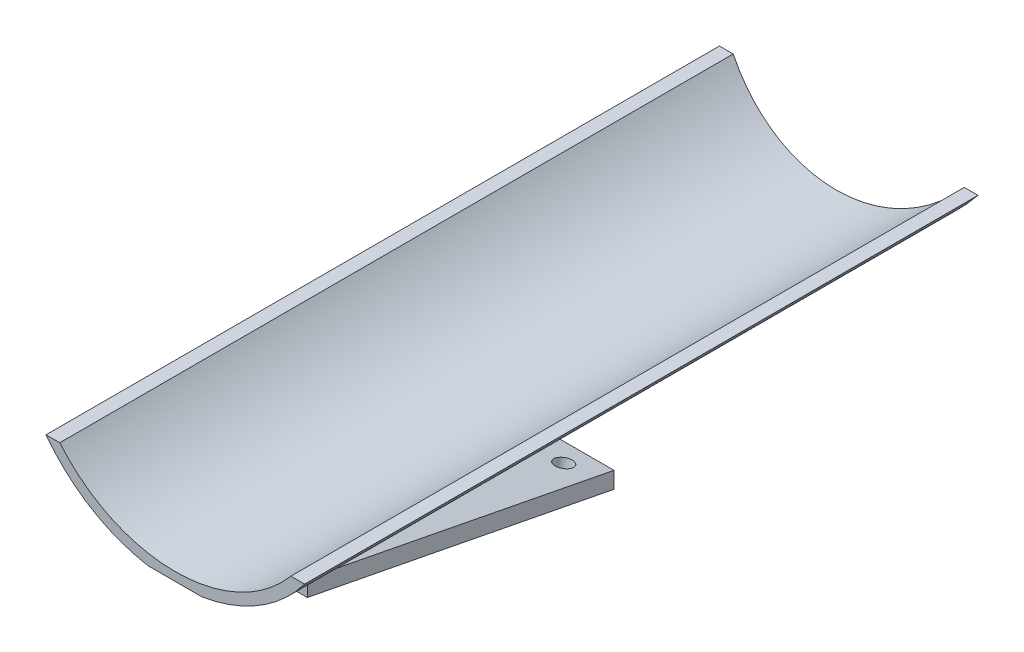
ISO-10303-21;
HEADER;
FILE_DESCRIPTION(('STEP AP214'),'2;1');
FILE_NAME('part.step','',(''),(''),'','','');
FILE_SCHEMA(('AUTOMOTIVE_DESIGN { 1 0 10303 214 1 1 1 1 }'));
ENDSEC;
DATA;
#1=APPLICATION_CONTEXT('core data for automotive mechanical design processes');
#2=APPLICATION_PROTOCOL_DEFINITION('international standard','automotive_design',2000,#1);
#3=PRODUCT_CONTEXT('',#1,'mechanical');
#4=PRODUCT('Part','Part','',(#3));
#5=PRODUCT_RELATED_PRODUCT_CATEGORY('part','',(#4));
#6=PRODUCT_DEFINITION_FORMATION('','',#4);
#7=PRODUCT_DEFINITION_CONTEXT('part definition',#1,'design');
#8=PRODUCT_DEFINITION('design','',#6,#7);
#9=PRODUCT_DEFINITION_SHAPE('','',#8);
#10=(LENGTH_UNIT() NAMED_UNIT(*) SI_UNIT(.MILLI.,.METRE.));
#11=(NAMED_UNIT(*) PLANE_ANGLE_UNIT() SI_UNIT($,.RADIAN.));
#12=(NAMED_UNIT(*) SI_UNIT($,.STERADIAN.) SOLID_ANGLE_UNIT());
#13=UNCERTAINTY_MEASURE_WITH_UNIT(LENGTH_MEASURE(1.E-05),#10,'distance_accuracy_value','');
#14=(GEOMETRIC_REPRESENTATION_CONTEXT(3) GLOBAL_UNCERTAINTY_ASSIGNED_CONTEXT((#13)) GLOBAL_UNIT_ASSIGNED_CONTEXT((#10,
#11,#12)) REPRESENTATION_CONTEXT('',''));
#15=CARTESIAN_POINT('',(0.,0.,0.));
#16=DIRECTION('',(0.,0.,1.));
#17=DIRECTION('',(1.,0.,0.));
#18=AXIS2_PLACEMENT_3D('',#15,#16,#17);
#19=CARTESIAN_POINT('',(2.5,-24.9798843569898,56.0656233600354));
#20=DIRECTION('',(0.,0.981627183447665,-0.190808995376538));
#21=DIRECTION('',(0.,0.190808995376538,0.981627183447665));
#22=AXIS2_PLACEMENT_3D('',#19,#20,#21);
#23=PLANE('',#22);
#24=CARTESIAN_POINT('',(-7.5,-24.0258393801071,60.9737592772737));
#25=DIRECTION('',(0.,-0.981627183447665,0.190808995376538));
#26=DIRECTION('',(0.,-0.190808995376538,-0.981627183447665));
#27=AXIS2_PLACEMENT_3D('',#24,#25,#26);
#28=CIRCLE('',#27,1.60000000000001);
#29=CARTESIAN_POINT('',(-7.5,-24.3311337727096,59.4031557837575));
#30=VERTEX_POINT('',#29);
#31=EDGE_CURVE('E207',#30,#30,#28,.T.);
#32=ORIENTED_EDGE('',*,*,#31,.F.);
#33=EDGE_LOOP('',(#32));
#34=FACE_BOUND('',#33,.T.);
#35=DIRECTION('',(0.,-0.190808995376538,-0.981627183447665));
#36=VECTOR('',#35,1.);
#37=CARTESIAN_POINT('',(-2.5,-24.9798843569898,56.0656233600354));
#38=LINE('',#37,#36);
#39=CARTESIAN_POINT('',(-2.50000000000001,-13.9129626251506,113.));
#40=VERTEX_POINT('',#39);
#41=CARTESIAN_POINT('',(-2.50000000000001,-24.9798843569898,56.0656233600354));
#42=VERTEX_POINT('',#41);
#43=EDGE_CURVE('E50',#40,#42,#38,.T.);
#44=ORIENTED_EDGE('',*,*,#43,.F.);
#45=DIRECTION('',(-1.,0.,0.));
#46=VECTOR('',#45,1.);
#47=CARTESIAN_POINT('',(2.5,-13.9129626251506,113.));
#48=LINE('',#47,#46);
#49=CARTESIAN_POINT('',(-12.5,-13.9129626251506,113.));
#50=VERTEX_POINT('',#49);
#51=EDGE_CURVE('E278',#40,#50,#48,.T.);
#52=ORIENTED_EDGE('',*,*,#51,.T.);
#53=DIRECTION('',(0.,-0.190808995376538,-0.981627183447665));
#54=VECTOR('',#53,1.);
#55=CARTESIAN_POINT('',(-12.5,-24.9798843569898,56.0656233600354));
#56=LINE('',#55,#54);
#57=CARTESIAN_POINT('',(-12.5,-24.9798843569898,56.0656233600354));
#58=VERTEX_POINT('',#57);
#59=EDGE_CURVE('E215',#50,#58,#56,.T.);
#60=ORIENTED_EDGE('',*,*,#59,.T.);
#61=DIRECTION('',(-1.,0.,0.));
#62=VECTOR('',#61,1.);
#63=CARTESIAN_POINT('',(2.5,-24.9798843569898,56.0656233600354));
#64=LINE('',#63,#62);
#65=EDGE_CURVE('E274',#42,#58,#64,.T.);
#66=ORIENTED_EDGE('',*,*,#65,.F.);
#67=EDGE_LOOP('',(#44,#52,#60,#66));
#68=FACE_BOUND('',#67,.T.);
#69=ADVANCED_FACE('F35',(#34,#68),#23,.F.);
#70=CARTESIAN_POINT('',(7.5,-24.0258393801071,60.9737592772737));
#71=DIRECTION('',(0.,-0.981627183447665,0.190808995376538));
#72=DIRECTION('',(0.,-0.190808995376538,-0.981627183447665));
#73=AXIS2_PLACEMENT_3D('',#70,#71,#72);
#74=CIRCLE('',#73,1.60000000000001);
#75=CARTESIAN_POINT('',(7.5,-24.3311337727096,59.4031557837575));
#76=VERTEX_POINT('',#75);
#77=EDGE_CURVE('E196',#76,#76,#74,.T.);
#78=ORIENTED_EDGE('',*,*,#77,.F.);
#79=EDGE_LOOP('',(#78));
#80=FACE_BOUND('',#79,.T.);
#81=DIRECTION('',(0.,0.190808995376538,0.981627183447665));
#82=VECTOR('',#81,1.);
#83=CARTESIAN_POINT('',(2.5,-24.9798843569898,56.0656233600354));
#84=LINE('',#83,#82);
#85=CARTESIAN_POINT('',(2.5,-24.9798843569898,56.0656233600354));
#86=VERTEX_POINT('',#85);
#87=CARTESIAN_POINT('',(2.49999999999999,-13.9129626251506,113.));
#88=VERTEX_POINT('',#87);
#89=EDGE_CURVE('E379',#86,#88,#84,.T.);
#90=ORIENTED_EDGE('',*,*,#89,.F.);
#91=CARTESIAN_POINT('',(12.5,-24.9798843569898,56.0656233600354));
#92=VERTEX_POINT('',#91);
#93=EDGE_CURVE('E275',#92,#86,#64,.T.);
#94=ORIENTED_EDGE('',*,*,#93,.F.);
#95=DIRECTION('',(0.,-0.190808995376538,-0.981627183447665));
#96=VECTOR('',#95,1.);
#97=CARTESIAN_POINT('',(12.5,-24.9798843569898,56.0656233600354));
#98=LINE('',#97,#96);
#99=CARTESIAN_POINT('',(12.5,-13.9129626251506,113.));
#100=VERTEX_POINT('',#99);
#101=EDGE_CURVE('E222',#100,#92,#98,.T.);
#102=ORIENTED_EDGE('',*,*,#101,.F.);
#103=EDGE_CURVE('E279',#100,#88,#48,.T.);
#104=ORIENTED_EDGE('',*,*,#103,.T.);
#105=EDGE_LOOP('',(#90,#94,#102,#104));
#106=FACE_BOUND('',#105,.T.);
#107=ADVANCED_FACE('F378',(#80,#106),#23,.F.);
#108=CARTESIAN_POINT('',(5.,-11.5803989154981,125.));
#109=DIRECTION('',(0.,1.,0.));
#110=DIRECTION('',(0.,0.,1.));
#111=AXIS2_PLACEMENT_3D('',#108,#109,#110);
#112=PLANE('',#111);
#113=DIRECTION('',(-1.,0.,0.));
#114=VECTOR('',#113,1.);
#115=CARTESIAN_POINT('',(12.5,-11.5803989154981,109.277470807496));
#116=LINE('',#115,#114);
#117=CARTESIAN_POINT('',(-2.5,-11.5803989154981,109.277470807496));
#118=VERTEX_POINT('',#117);
#119=CARTESIAN_POINT('',(-4.99999999999997,-11.5803989154981,109.277470807496));
#120=VERTEX_POINT('',#119);
#121=EDGE_CURVE('E341',#118,#120,#116,.T.);
#122=ORIENTED_EDGE('',*,*,#121,.T.);
#123=DIRECTION('',(0.,0.,-1.));
#124=VECTOR('',#123,1.);
#125=CARTESIAN_POINT('',(-5.00000000000002,-11.5803989154981,125.));
#126=LINE('',#125,#124);
#127=CARTESIAN_POINT('',(-5.00000000000002,-11.5803989154981,2.67354575013348));
#128=VERTEX_POINT('',#127);
#129=EDGE_CURVE('E315',#120,#128,#126,.T.);
#130=ORIENTED_EDGE('',*,*,#129,.T.);
#131=DIRECTION('',(1.,0.,0.));
#132=VECTOR('',#131,1.);
#133=CARTESIAN_POINT('',(5.,-11.5803989154981,2.67354575013348));
#134=LINE('',#133,#132);
#135=CARTESIAN_POINT('',(5.,-11.5803989154981,2.67354575013348));
#136=VERTEX_POINT('',#135);
#137=EDGE_CURVE('E285',#128,#136,#134,.T.);
#138=ORIENTED_EDGE('',*,*,#137,.T.);
#139=DIRECTION('',(0.,0.,-1.));
#140=VECTOR('',#139,1.);
#141=CARTESIAN_POINT('',(5.,-11.5803989154981,125.));
#142=LINE('',#141,#140);
#143=CARTESIAN_POINT('',(5.,-11.5803989154981,109.277470807496));
#144=VERTEX_POINT('',#143);
#145=EDGE_CURVE('E58',#144,#136,#142,.T.);
#146=ORIENTED_EDGE('',*,*,#145,.F.);
#147=CARTESIAN_POINT('',(2.5,-11.5803989154981,109.277470807496));
#148=VERTEX_POINT('',#147);
#149=EDGE_CURVE('E247',#144,#148,#116,.T.);
#150=ORIENTED_EDGE('',*,*,#149,.T.);
#151=DIRECTION('',(0.,0.,1.));
#152=VECTOR('',#151,1.);
#153=CARTESIAN_POINT('',(2.5,-11.5803989154981,113.));
#154=LINE('',#153,#152);
#155=CARTESIAN_POINT('',(2.5,-11.5803989154981,56.0656233600354));
#156=VERTEX_POINT('',#155);
#157=EDGE_CURVE('E262',#156,#148,#154,.T.);
#158=ORIENTED_EDGE('',*,*,#157,.F.);
#159=DIRECTION('',(-1.,0.,0.));
#160=VECTOR('',#159,1.);
#161=CARTESIAN_POINT('',(2.5,-11.5803989154981,56.0656233600354));
#162=LINE('',#161,#160);
#163=CARTESIAN_POINT('',(-2.5,-11.5803989154981,56.0656233600354));
#164=VERTEX_POINT('',#163);
#165=EDGE_CURVE('E271',#156,#164,#162,.T.);
#166=ORIENTED_EDGE('',*,*,#165,.T.);
#167=DIRECTION('',(0.,0.,1.));
#168=VECTOR('',#167,1.);
#169=CARTESIAN_POINT('',(-2.5,-11.5803989154981,113.));
#170=LINE('',#169,#168);
#171=EDGE_CURVE('E263',#164,#118,#170,.T.);
#172=ORIENTED_EDGE('',*,*,#171,.T.);
#173=EDGE_LOOP('',(#122,#130,#138,#146,#150,#158,#166,#172));
#174=FACE_BOUND('',#173,.T.);
#175=ADVANCED_FACE('F339',(#174),#112,.F.);
#176=DIRECTION('',(-1.,0.,0.));
#177=VECTOR('',#176,1.);
#178=CARTESIAN_POINT('',(2.5,-11.5803989154981,113.));
#179=LINE('',#178,#177);
#180=CARTESIAN_POINT('',(5.,-11.5803989154981,113.));
#181=VERTEX_POINT('',#180);
#182=CARTESIAN_POINT('',(-4.99999999999999,-11.5803989154981,113.));
#183=VERTEX_POINT('',#182);
#184=EDGE_CURVE('E266',#181,#183,#179,.T.);
#185=ORIENTED_EDGE('',*,*,#184,.F.);
#186=CARTESIAN_POINT('',(5.,-11.5803989154981,125.));
#187=VERTEX_POINT('',#186);
#188=EDGE_CURVE('E312',#187,#181,#142,.T.);
#189=ORIENTED_EDGE('',*,*,#188,.F.);
#190=DIRECTION('',(1.,0.,0.));
#191=VECTOR('',#190,1.);
#192=CARTESIAN_POINT('',(5.,-11.5803989154981,125.));
#193=LINE('',#192,#191);
#194=CARTESIAN_POINT('',(-5.00000000000002,-11.5803989154981,125.));
#195=VERTEX_POINT('',#194);
#196=EDGE_CURVE('E306',#195,#187,#193,.T.);
#197=ORIENTED_EDGE('',*,*,#196,.F.);
#198=EDGE_CURVE('E316',#195,#183,#126,.T.);
#199=ORIENTED_EDGE('',*,*,#198,.T.);
#200=EDGE_LOOP('',(#185,#189,#197,#199));
#201=FACE_BOUND('',#200,.T.);
#202=ADVANCED_FACE('F360',(#201),#112,.F.);
#203=CARTESIAN_POINT('',(2.5,0.,0.));
#204=DIRECTION('',(-1.,0.,0.));
#205=DIRECTION('',(0.,0.,1.));
#206=AXIS2_PLACEMENT_3D('',#203,#204,#205);
#207=PLANE('',#206);
#208=DIRECTION('',(0.,0.190808995376538,0.981627183447665));
#209=VECTOR('',#208,1.);
#210=CARTESIAN_POINT('',(2.5,-31.626809447846,6.1476289975118));
#211=LINE('',#210,#209);
#212=CARTESIAN_POINT('',(2.5,-21.9237342721242,56.0656233600354));
#213=VERTEX_POINT('',#212);
#214=EDGE_CURVE('E256',#213,#148,#211,.T.);
#215=ORIENTED_EDGE('',*,*,#214,.F.);
#216=DIRECTION('',(0.,1.,0.));
#217=VECTOR('',#216,1.);
#218=CARTESIAN_POINT('',(2.5,-11.5803989154981,56.0656233600354));
#219=LINE('',#218,#217);
#220=EDGE_CURVE('E260',#213,#156,#219,.T.);
#221=ORIENTED_EDGE('',*,*,#220,.T.);
#222=ORIENTED_EDGE('',*,*,#157,.T.);
#223=EDGE_LOOP('',(#215,#221,#222));
#224=FACE_BOUND('',#223,.T.);
#225=ADVANCED_FACE('F459',(#224),#207,.F.);
#226=CARTESIAN_POINT('',(-2.5,0.,0.));
#227=DIRECTION('',(-1.,0.,0.));
#228=DIRECTION('',(0.,0.,1.));
#229=AXIS2_PLACEMENT_3D('',#226,#227,#228);
#230=PLANE('',#229);
#231=DIRECTION('',(0.,1.,0.));
#232=VECTOR('',#231,1.);
#233=CARTESIAN_POINT('',(-2.5,-11.5803989154981,56.0656233600354));
#234=LINE('',#233,#232);
#235=CARTESIAN_POINT('',(-2.5,-21.9237342721242,56.0656233600354));
#236=VERTEX_POINT('',#235);
#237=EDGE_CURVE('E259',#236,#164,#234,.T.);
#238=ORIENTED_EDGE('',*,*,#237,.F.);
#239=DIRECTION('',(0.,0.190808995376538,0.981627183447665));
#240=VECTOR('',#239,1.);
#241=CARTESIAN_POINT('',(-2.5,-31.626809447846,6.1476289975118));
#242=LINE('',#241,#240);
#243=EDGE_CURVE('E12',#236,#118,#242,.T.);
#244=ORIENTED_EDGE('',*,*,#243,.T.);
#245=ORIENTED_EDGE('',*,*,#171,.F.);
#246=EDGE_LOOP('',(#238,#244,#245));
#247=FACE_BOUND('',#246,.T.);
#248=ADVANCED_FACE('F455',(#247),#230,.T.);
#249=CARTESIAN_POINT('',(0.,18.,125.));
#250=DIRECTION('',(0.,0.,-1.));
#251=DIRECTION('',(-1.,0.,0.));
#252=AXIS2_PLACEMENT_3D('',#249,#250,#251);
#253=CYLINDRICAL_SURFACE('',#252,30.);
#254=ORIENTED_EDGE('',*,*,#188,.T.);
#255=DIRECTION('',(0.,0.,-1.));
#256=VECTOR('',#255,1.);
#257=CARTESIAN_POINT('',(4.99999999999995,-11.5803989154981,125.));
#258=LINE('',#257,#256);
#259=EDGE_CURVE('E253',#144,#181,#258,.F.);
#260=ORIENTED_EDGE('',*,*,#259,.F.);
#261=ORIENTED_EDGE('',*,*,#145,.T.);
#262=CARTESIAN_POINT('',(0.,18.,-4.15562744026013));
#263=DIRECTION('',(0.,0.224951054343866,0.974370064785235));
#264=DIRECTION('',(0.,0.974370064785235,-0.224951054343866));
#265=AXIS2_PLACEMENT_3D('',#262,#263,#264);
#266=ELLIPSE('',#265,30.7891232338017,30.);
#267=CARTESIAN_POINT('',(24.,0.,0.));
#268=VERTEX_POINT('',#267);
#269=EDGE_CURVE('E287',#136,#268,#266,.T.);
#270=ORIENTED_EDGE('',*,*,#269,.T.);
#271=DIRECTION('',(0.,0.,-1.));
#272=VECTOR('',#271,1.);
#273=CARTESIAN_POINT('',(24.,0.,125.));
#274=LINE('',#273,#272);
#275=CARTESIAN_POINT('',(24.,0.,125.));
#276=VERTEX_POINT('',#275);
#277=EDGE_CURVE('E43',#276,#268,#274,.T.);
#278=ORIENTED_EDGE('',*,*,#277,.F.);
#279=CARTESIAN_POINT('',(0.,18.,125.));
#280=DIRECTION('',(0.,0.,1.));
#281=DIRECTION('',(1.,0.,0.));
#282=AXIS2_PLACEMENT_3D('',#279,#280,#281);
#283=CIRCLE('',#282,30.);
#284=EDGE_CURVE('E294',#187,#276,#283,.T.);
#285=ORIENTED_EDGE('',*,*,#284,.F.);
#286=EDGE_LOOP('',(#254,#260,#261,#270,#278,#285));
#287=FACE_BOUND('',#286,.T.);
#288=ADVANCED_FACE('F37',(#287),#253,.T.);
#289=CARTESIAN_POINT('',(21.4476105895272,0.,125.));
#290=DIRECTION('',(0.,-1.,0.));
#291=DIRECTION('',(0.,0.,-1.));
#292=AXIS2_PLACEMENT_3D('',#289,#290,#291);
#293=PLANE('',#292);
#294=DIRECTION('',(-1.,0.,0.));
#295=VECTOR('',#294,1.);
#296=CARTESIAN_POINT('',(21.4476105895272,0.,0.));
#297=LINE('',#296,#295);
#298=CARTESIAN_POINT('',(21.4476105895272,0.,0.));
#299=VERTEX_POINT('',#298);
#300=EDGE_CURVE('E293',#268,#299,#297,.T.);
#301=ORIENTED_EDGE('',*,*,#300,.T.);
#302=DIRECTION('',(0.,0.,-1.));
#303=VECTOR('',#302,1.);
#304=CARTESIAN_POINT('',(21.4476105895272,0.,125.));
#305=LINE('',#304,#303);
#306=CARTESIAN_POINT('',(21.4476105895272,0.,125.));
#307=VERTEX_POINT('',#306);
#308=EDGE_CURVE('E325',#307,#299,#305,.T.);
#309=ORIENTED_EDGE('',*,*,#308,.F.);
#310=DIRECTION('',(-1.,0.,0.));
#311=VECTOR('',#310,1.);
#312=CARTESIAN_POINT('',(21.4476105895272,0.,125.));
#313=LINE('',#312,#311);
#314=EDGE_CURVE('E297',#276,#307,#313,.T.);
#315=ORIENTED_EDGE('',*,*,#314,.F.);
#316=ORIENTED_EDGE('',*,*,#277,.T.);
#317=EDGE_LOOP('',(#301,#309,#315,#316));
#318=FACE_BOUND('',#317,.T.);
#319=ADVANCED_FACE('F330',(#318),#293,.F.);
#320=CARTESIAN_POINT('',(0.,18.,125.));
#321=DIRECTION('',(0.,0.,-1.));
#322=DIRECTION('',(-1.,0.,0.));
#323=AXIS2_PLACEMENT_3D('',#320,#321,#322);
#324=CYLINDRICAL_SURFACE('',#323,28.);
#325=ORIENTED_EDGE('',*,*,#308,.T.);
#326=CARTESIAN_POINT('',(0.,18.,-4.15562744026013));
#327=DIRECTION('',(0.,0.224951054343866,0.974370064785235));
#328=DIRECTION('',(0.,0.974370064785235,-0.224951054343866));
#329=AXIS2_PLACEMENT_3D('',#326,#327,#328);
#330=ELLIPSE('',#329,28.736515018215,28.);
#331=CARTESIAN_POINT('',(-21.4476105895272,0.,0.));
#332=VERTEX_POINT('',#331);
#333=EDGE_CURVE('E290',#299,#332,#330,.F.);
#334=ORIENTED_EDGE('',*,*,#333,.T.);
#335=DIRECTION('',(0.,0.,-1.));
#336=VECTOR('',#335,1.);
#337=CARTESIAN_POINT('',(-21.4476105895272,0.,125.));
#338=LINE('',#337,#336);
#339=CARTESIAN_POINT('',(-21.4476105895272,0.,125.));
#340=VERTEX_POINT('',#339);
#341=EDGE_CURVE('E322',#340,#332,#338,.T.);
#342=ORIENTED_EDGE('',*,*,#341,.F.);
#343=CARTESIAN_POINT('',(0.,18.,125.));
#344=DIRECTION('',(0.,0.,-1.));
#345=DIRECTION('',(-1.,0.,0.));
#346=AXIS2_PLACEMENT_3D('',#343,#344,#345);
#347=CIRCLE('',#346,28.);
#348=EDGE_CURVE('E300',#307,#340,#347,.T.);
#349=ORIENTED_EDGE('',*,*,#348,.F.);
#350=EDGE_LOOP('',(#325,#334,#342,#349));
#351=FACE_BOUND('',#350,.T.);
#352=ADVANCED_FACE('F354',(#351),#324,.F.);
#353=CARTESIAN_POINT('',(-24.,0.,125.));
#354=DIRECTION('',(0.,-1.,0.));
#355=DIRECTION('',(0.,0.,-1.));
#356=AXIS2_PLACEMENT_3D('',#353,#354,#355);
#357=PLANE('',#356);
#358=DIRECTION('',(-1.,0.,0.));
#359=VECTOR('',#358,1.);
#360=CARTESIAN_POINT('',(-24.,0.,0.));
#361=LINE('',#360,#359);
#362=CARTESIAN_POINT('',(-24.,0.,0.));
#363=VERTEX_POINT('',#362);
#364=EDGE_CURVE('E298',#332,#363,#361,.T.);
#365=ORIENTED_EDGE('',*,*,#364,.T.);
#366=DIRECTION('',(0.,0.,-1.));
#367=VECTOR('',#366,1.);
#368=CARTESIAN_POINT('',(-24.,0.,125.));
#369=LINE('',#368,#367);
#370=CARTESIAN_POINT('',(-24.,0.,125.));
#371=VERTEX_POINT('',#370);
#372=EDGE_CURVE('E319',#371,#363,#369,.T.);
#373=ORIENTED_EDGE('',*,*,#372,.F.);
#374=DIRECTION('',(-1.,0.,0.));
#375=VECTOR('',#374,1.);
#376=CARTESIAN_POINT('',(-24.,0.,125.));
#377=LINE('',#376,#375);
#378=EDGE_CURVE('E302',#340,#371,#377,.T.);
#379=ORIENTED_EDGE('',*,*,#378,.F.);
#380=ORIENTED_EDGE('',*,*,#341,.T.);
#381=EDGE_LOOP('',(#365,#373,#379,#380));
#382=FACE_BOUND('',#381,.T.);
#383=ADVANCED_FACE('F349',(#382),#357,.F.);
#384=CARTESIAN_POINT('',(0.,18.,125.));
#385=DIRECTION('',(0.,0.,-1.));
#386=DIRECTION('',(-1.,0.,0.));
#387=AXIS2_PLACEMENT_3D('',#384,#385,#386);
#388=CYLINDRICAL_SURFACE('',#387,30.);
#389=ORIENTED_EDGE('',*,*,#372,.T.);
#390=CARTESIAN_POINT('',(0.,18.,-4.15562744026013));
#391=DIRECTION('',(0.,0.224951054343866,0.974370064785235));
#392=DIRECTION('',(0.,0.974370064785235,-0.224951054343866));
#393=AXIS2_PLACEMENT_3D('',#390,#391,#392);
#394=ELLIPSE('',#393,30.7891232338018,30.);
#395=EDGE_CURVE('E282',#363,#128,#394,.T.);
#396=ORIENTED_EDGE('',*,*,#395,.T.);
#397=ORIENTED_EDGE('',*,*,#129,.F.);
#398=DIRECTION('',(0.,0.,-1.));
#399=VECTOR('',#398,1.);
#400=CARTESIAN_POINT('',(-4.99999999999997,-11.5803989154981,125.));
#401=LINE('',#400,#399);
#402=EDGE_CURVE('E251',#183,#120,#401,.T.);
#403=ORIENTED_EDGE('',*,*,#402,.F.);
#404=ORIENTED_EDGE('',*,*,#198,.F.);
#405=CARTESIAN_POINT('',(0.,18.,125.));
#406=DIRECTION('',(0.,0.,1.));
#407=DIRECTION('',(1.,0.,0.));
#408=AXIS2_PLACEMENT_3D('',#405,#406,#407);
#409=CIRCLE('',#408,30.);
#410=EDGE_CURVE('E304',#371,#195,#409,.T.);
#411=ORIENTED_EDGE('',*,*,#410,.F.);
#412=EDGE_LOOP('',(#389,#396,#397,#403,#404,#411));
#413=FACE_BOUND('',#412,.T.);
#414=ADVANCED_FACE('F344',(#413),#388,.T.);
#415=CARTESIAN_POINT('',(0.,18.,125.));
#416=DIRECTION('',(0.,0.,1.));
#417=DIRECTION('',(1.,0.,0.));
#418=AXIS2_PLACEMENT_3D('',#415,#416,#417);
#419=PLANE('',#418);
#420=ORIENTED_EDGE('',*,*,#284,.T.);
#421=ORIENTED_EDGE('',*,*,#314,.T.);
#422=ORIENTED_EDGE('',*,*,#348,.T.);
#423=ORIENTED_EDGE('',*,*,#378,.T.);
#424=ORIENTED_EDGE('',*,*,#410,.T.);
#425=ORIENTED_EDGE('',*,*,#196,.T.);
#426=EDGE_LOOP('',(#420,#421,#422,#423,#424,#425));
#427=FACE_BOUND('',#426,.T.);
#428=ADVANCED_FACE('F356',(#427),#419,.T.);
#429=CARTESIAN_POINT('',(0.,0.,0.));
#430=DIRECTION('',(0.,0.224951054343866,0.974370064785235));
#431=DIRECTION('',(0.,-0.974370064785235,0.224951054343866));
#432=AXIS2_PLACEMENT_3D('',#429,#430,#431);
#433=PLANE('',#432);
#434=ORIENTED_EDGE('',*,*,#300,.F.);
#435=ORIENTED_EDGE('',*,*,#269,.F.);
#436=ORIENTED_EDGE('',*,*,#137,.F.);
#437=ORIENTED_EDGE('',*,*,#395,.F.);
#438=ORIENTED_EDGE('',*,*,#364,.F.);
#439=ORIENTED_EDGE('',*,*,#333,.F.);
#440=EDGE_LOOP('',(#434,#435,#436,#437,#438,#439));
#441=FACE_BOUND('',#440,.T.);
#442=ADVANCED_FACE('F337',(#441),#433,.F.);
#443=CARTESIAN_POINT('',(2.5,-13.9129626251506,113.));
#444=DIRECTION('',(0.,0.,-1.));
#445=DIRECTION('',(-1.,0.,0.));
#446=AXIS2_PLACEMENT_3D('',#443,#444,#445);
#447=PLANE('',#446);
#448=ORIENTED_EDGE('',*,*,#184,.T.);
#449=DIRECTION('',(-1.,0.,0.));
#450=VECTOR('',#449,1.);
#451=CARTESIAN_POINT('',(12.5,-11.5803989154981,113.));
#452=LINE('',#451,#450);
#453=CARTESIAN_POINT('',(-12.5,-11.5803989154981,113.));
#454=VERTEX_POINT('',#453);
#455=EDGE_CURVE('E225',#183,#454,#452,.T.);
#456=ORIENTED_EDGE('',*,*,#455,.T.);
#457=DIRECTION('',(0.,-1.,0.));
#458=VECTOR('',#457,1.);
#459=CARTESIAN_POINT('',(-12.5,-13.9129626251506,113.));
#460=LINE('',#459,#458);
#461=EDGE_CURVE('E234',#454,#50,#460,.T.);
#462=ORIENTED_EDGE('',*,*,#461,.T.);
#463=ORIENTED_EDGE('',*,*,#51,.F.);
#464=DIRECTION('',(-1.,0.,0.));
#465=VECTOR('',#464,1.);
#466=CARTESIAN_POINT('',(-2.50000000000001,-13.9129626251506,113.));
#467=LINE('',#466,#465);
#468=EDGE_CURVE('E190',#88,#40,#467,.T.);
#469=ORIENTED_EDGE('',*,*,#468,.F.);
#470=ORIENTED_EDGE('',*,*,#103,.F.);
#471=DIRECTION('',(0.,-1.,0.));
#472=VECTOR('',#471,1.);
#473=CARTESIAN_POINT('',(12.5,-13.9129626251506,113.));
#474=LINE('',#473,#472);
#475=CARTESIAN_POINT('',(12.5,-11.5803989154981,113.));
#476=VERTEX_POINT('',#475);
#477=EDGE_CURVE('E219',#476,#100,#474,.T.);
#478=ORIENTED_EDGE('',*,*,#477,.F.);
#479=EDGE_CURVE('E239',#476,#181,#452,.T.);
#480=ORIENTED_EDGE('',*,*,#479,.T.);
#481=EDGE_LOOP('',(#448,#456,#462,#463,#469,#470,#478,#480));
#482=FACE_BOUND('',#481,.T.);
#483=ADVANCED_FACE('F369',(#482),#447,.F.);
#484=CARTESIAN_POINT('',(2.5,-11.5803989154981,56.0656233600354));
#485=DIRECTION('',(0.,0.,1.));
#486=DIRECTION('',(1.,0.,0.));
#487=AXIS2_PLACEMENT_3D('',#484,#485,#486);
#488=PLANE('',#487);
#489=ORIENTED_EDGE('',*,*,#93,.T.);
#490=DIRECTION('',(1.,0.,0.));
#491=VECTOR('',#490,1.);
#492=CARTESIAN_POINT('',(-2.5,-24.9798843569898,56.0656233600354));
#493=LINE('',#492,#491);
#494=EDGE_CURVE('E383',#42,#86,#493,.T.);
#495=ORIENTED_EDGE('',*,*,#494,.F.);
#496=ORIENTED_EDGE('',*,*,#65,.T.);
#497=DIRECTION('',(0.,1.,0.));
#498=VECTOR('',#497,1.);
#499=CARTESIAN_POINT('',(-12.5,-21.9237342721242,56.0656233600354));
#500=LINE('',#499,#498);
#501=CARTESIAN_POINT('',(-12.5,-21.9237342721242,56.0656233600354));
#502=VERTEX_POINT('',#501);
#503=EDGE_CURVE('E210',#58,#502,#500,.T.);
#504=ORIENTED_EDGE('',*,*,#503,.T.);
#505=DIRECTION('',(-1.,0.,0.));
#506=VECTOR('',#505,1.);
#507=CARTESIAN_POINT('',(12.5,-21.9237342721242,56.0656233600354));
#508=LINE('',#507,#506);
#509=EDGE_CURVE('E246',#236,#502,#508,.T.);
#510=ORIENTED_EDGE('',*,*,#509,.F.);
#511=ORIENTED_EDGE('',*,*,#237,.T.);
#512=ORIENTED_EDGE('',*,*,#165,.F.);
#513=ORIENTED_EDGE('',*,*,#220,.F.);
#514=CARTESIAN_POINT('',(12.5,-21.9237342721242,56.0656233600354));
#515=VERTEX_POINT('',#514);
#516=EDGE_CURVE('E248',#515,#213,#508,.T.);
#517=ORIENTED_EDGE('',*,*,#516,.F.);
#518=DIRECTION('',(0.,1.,0.));
#519=VECTOR('',#518,1.);
#520=CARTESIAN_POINT('',(12.5,-21.9237342721242,56.0656233600354));
#521=LINE('',#520,#519);
#522=EDGE_CURVE('E211',#92,#515,#521,.T.);
#523=ORIENTED_EDGE('',*,*,#522,.F.);
#524=EDGE_LOOP('',(#489,#495,#496,#504,#510,#511,#512,#513,#517,#523));
#525=FACE_BOUND('',#524,.T.);
#526=ADVANCED_FACE('F382',(#525),#488,.F.);
#527=CARTESIAN_POINT('',(-12.5,0.,0.));
#528=DIRECTION('',(1.,0.,0.));
#529=DIRECTION('',(0.,0.,-1.));
#530=AXIS2_PLACEMENT_3D('',#527,#528,#529);
#531=PLANE('',#530);
#532=ORIENTED_EDGE('',*,*,#503,.F.);
#533=ORIENTED_EDGE('',*,*,#59,.F.);
#534=ORIENTED_EDGE('',*,*,#461,.F.);
#535=DIRECTION('',(0.,0.,1.));
#536=VECTOR('',#535,1.);
#537=CARTESIAN_POINT('',(-12.5,-11.5803989154981,113.));
#538=LINE('',#537,#536);
#539=CARTESIAN_POINT('',(-12.5,-11.5803989154981,109.277470807496));
#540=VERTEX_POINT('',#539);
#541=EDGE_CURVE('E231',#540,#454,#538,.T.);
#542=ORIENTED_EDGE('',*,*,#541,.F.);
#543=DIRECTION('',(0.,0.190808995376538,0.981627183447665));
#544=VECTOR('',#543,1.);
#545=CARTESIAN_POINT('',(-12.5,-11.5803989154981,109.277470807496));
#546=LINE('',#545,#544);
#547=EDGE_CURVE('E228',#502,#540,#546,.T.);
#548=ORIENTED_EDGE('',*,*,#547,.F.);
#549=EDGE_LOOP('',(#532,#533,#534,#542,#548));
#550=FACE_BOUND('',#549,.T.);
#551=ADVANCED_FACE('F400',(#550),#531,.F.);
#552=CARTESIAN_POINT('',(12.5,-11.5803989154981,109.277470807496));
#553=DIRECTION('',(0.,-0.981627183447665,0.190808995376538));
#554=DIRECTION('',(0.,-0.190808995376538,-0.981627183447665));
#555=AXIS2_PLACEMENT_3D('',#552,#553,#554);
#556=PLANE('',#555);
#557=CARTESIAN_POINT('',(-7.5,-21.0809578297641,60.4013322911441));
#558=DIRECTION('',(0.,-0.981627183447665,0.190808995376538));
#559=DIRECTION('',(0.,-0.190808995376538,-0.981627183447665));
#560=AXIS2_PLACEMENT_3D('',#557,#558,#559);
#561=CIRCLE('',#560,1.60000000000001);
#562=CARTESIAN_POINT('',(-7.5,-21.3862522223666,58.8307287976278));
#563=VERTEX_POINT('',#562);
#564=EDGE_CURVE('E204',#563,#563,#561,.F.);
#565=ORIENTED_EDGE('',*,*,#564,.F.);
#566=EDGE_LOOP('',(#565));
#567=FACE_BOUND('',#566,.T.);
#568=ORIENTED_EDGE('',*,*,#243,.F.);
#569=ORIENTED_EDGE('',*,*,#509,.T.);
#570=ORIENTED_EDGE('',*,*,#547,.T.);
#571=EDGE_CURVE('E242',#120,#540,#116,.T.);
#572=ORIENTED_EDGE('',*,*,#571,.F.);
#573=ORIENTED_EDGE('',*,*,#121,.F.);
#574=EDGE_LOOP('',(#568,#569,#570,#572,#573));
#575=FACE_BOUND('',#574,.T.);
#576=ADVANCED_FACE('F396',(#567,#575),#556,.F.);
#577=CARTESIAN_POINT('',(12.5,-11.5803989154981,113.));
#578=DIRECTION('',(0.,-1.,0.));
#579=DIRECTION('',(0.,0.,-1.));
#580=AXIS2_PLACEMENT_3D('',#577,#578,#579);
#581=PLANE('',#580);
#582=ORIENTED_EDGE('',*,*,#455,.F.);
#583=ORIENTED_EDGE('',*,*,#402,.T.);
#584=ORIENTED_EDGE('',*,*,#571,.T.);
#585=ORIENTED_EDGE('',*,*,#541,.T.);
#586=EDGE_LOOP('',(#582,#583,#584,#585));
#587=FACE_BOUND('',#586,.T.);
#588=ADVANCED_FACE('F391',(#587),#581,.F.);
#589=CARTESIAN_POINT('',(7.5,-21.0809578297641,60.4013322911441));
#590=DIRECTION('',(0.,-0.981627183447665,0.190808995376538));
#591=DIRECTION('',(0.,-0.190808995376538,-0.981627183447665));
#592=AXIS2_PLACEMENT_3D('',#589,#590,#591);
#593=CIRCLE('',#592,1.60000000000001);
#594=CARTESIAN_POINT('',(7.5,-21.3862522223666,58.8307287976278));
#595=VERTEX_POINT('',#594);
#596=EDGE_CURVE('E193',#595,#595,#593,.F.);
#597=ORIENTED_EDGE('',*,*,#596,.F.);
#598=EDGE_LOOP('',(#597));
#599=FACE_BOUND('',#598,.T.);
#600=ORIENTED_EDGE('',*,*,#516,.T.);
#601=ORIENTED_EDGE('',*,*,#214,.T.);
#602=ORIENTED_EDGE('',*,*,#149,.F.);
#603=CARTESIAN_POINT('',(12.5,-11.5803989154981,109.277470807496));
#604=VERTEX_POINT('',#603);
#605=EDGE_CURVE('E243',#604,#144,#116,.T.);
#606=ORIENTED_EDGE('',*,*,#605,.F.);
#607=DIRECTION('',(0.,0.190808995376538,0.981627183447665));
#608=VECTOR('',#607,1.);
#609=CARTESIAN_POINT('',(12.5,-11.5803989154981,109.277470807496));
#610=LINE('',#609,#608);
#611=EDGE_CURVE('E214',#515,#604,#610,.T.);
#612=ORIENTED_EDGE('',*,*,#611,.F.);
#613=EDGE_LOOP('',(#600,#601,#602,#606,#612));
#614=FACE_BOUND('',#613,.T.);
#615=ADVANCED_FACE('F387',(#599,#614),#556,.F.);
#616=ORIENTED_EDGE('',*,*,#605,.T.);
#617=ORIENTED_EDGE('',*,*,#259,.T.);
#618=ORIENTED_EDGE('',*,*,#479,.F.);
#619=DIRECTION('',(0.,0.,1.));
#620=VECTOR('',#619,1.);
#621=CARTESIAN_POINT('',(12.5,-11.5803989154981,113.));
#622=LINE('',#621,#620);
#623=EDGE_CURVE('E217',#604,#476,#622,.T.);
#624=ORIENTED_EDGE('',*,*,#623,.F.);
#625=EDGE_LOOP('',(#616,#617,#618,#624));
#626=FACE_BOUND('',#625,.T.);
#627=ADVANCED_FACE('F364',(#626),#581,.F.);
#628=CARTESIAN_POINT('',(12.5,0.,0.));
#629=DIRECTION('',(1.,0.,0.));
#630=DIRECTION('',(0.,0.,-1.));
#631=AXIS2_PLACEMENT_3D('',#628,#629,#630);
#632=PLANE('',#631);
#633=ORIENTED_EDGE('',*,*,#522,.T.);
#634=ORIENTED_EDGE('',*,*,#611,.T.);
#635=ORIENTED_EDGE('',*,*,#623,.T.);
#636=ORIENTED_EDGE('',*,*,#477,.T.);
#637=ORIENTED_EDGE('',*,*,#101,.T.);
#638=EDGE_LOOP('',(#633,#634,#635,#636,#637));
#639=FACE_BOUND('',#638,.T.);
#640=ADVANCED_FACE('F374',(#639),#632,.T.);
#641=CARTESIAN_POINT('',(-7.5,10.5470025133059,54.2534795822629));
#642=DIRECTION('',(0.,-0.981627183447665,0.190808995376538));
#643=DIRECTION('',(0.,-0.190808995376538,-0.981627183447665));
#644=AXIS2_PLACEMENT_3D('',#641,#642,#643);
#645=CYLINDRICAL_SURFACE('',#644,1.60000000000001);
#646=ORIENTED_EDGE('',*,*,#31,.T.);
#647=EDGE_LOOP('',(#646));
#648=FACE_BOUND('',#647,.T.);
#649=ORIENTED_EDGE('',*,*,#564,.T.);
#650=EDGE_LOOP('',(#649));
#651=FACE_BOUND('',#650,.T.);
#652=ADVANCED_FACE('F477',(#648,#651),#645,.F.);
#653=CARTESIAN_POINT('',(7.5,10.5470025133059,54.2534795822629));
#654=DIRECTION('',(0.,-0.981627183447665,0.190808995376538));
#655=DIRECTION('',(0.,-0.190808995376538,-0.981627183447665));
#656=AXIS2_PLACEMENT_3D('',#653,#654,#655);
#657=CYLINDRICAL_SURFACE('',#656,1.60000000000001);
#658=ORIENTED_EDGE('',*,*,#77,.T.);
#659=EDGE_LOOP('',(#658));
#660=FACE_BOUND('',#659,.T.);
#661=ORIENTED_EDGE('',*,*,#596,.T.);
#662=EDGE_LOOP('',(#661));
#663=FACE_BOUND('',#662,.T.);
#664=ADVANCED_FACE('F480',(#660,#663),#657,.F.);
#665=CARTESIAN_POINT('',(-2.5,-27.9247659073328,56.638050346165));
#666=DIRECTION('',(1.,0.,0.));
#667=DIRECTION('',(0.,0.,-1.));
#668=AXIS2_PLACEMENT_3D('',#665,#666,#667);
#669=PLANE('',#668);
#670=ORIENTED_EDGE('',*,*,#43,.T.);
#671=DIRECTION('',(0.,0.981627183447665,-0.190808995376538));
#672=VECTOR('',#671,1.);
#673=CARTESIAN_POINT('',(-2.5,-27.9247659073328,56.638050346165));
#674=LINE('',#673,#672);
#675=CARTESIAN_POINT('',(-2.5,-27.9247659073328,56.638050346165));
#676=VERTEX_POINT('',#675);
#677=EDGE_CURVE('E176',#676,#42,#674,.T.);
#678=ORIENTED_EDGE('',*,*,#677,.F.);
#679=DIRECTION('',(0.,-0.190808995376538,-0.981627183447665));
#680=VECTOR('',#679,1.);
#681=CARTESIAN_POINT('',(-2.5,-27.9247659073328,56.638050346165));
#682=LINE('',#681,#680);
#683=CARTESIAN_POINT('',(-2.50000000000001,-16.8578441754936,113.57242698613));
#684=VERTEX_POINT('',#683);
#685=EDGE_CURVE('E183',#684,#676,#682,.T.);
#686=ORIENTED_EDGE('',*,*,#685,.F.);
#687=DIRECTION('',(0.,0.981627183447665,-0.190808995376538));
#688=VECTOR('',#687,1.);
#689=CARTESIAN_POINT('',(-2.50000000000001,-16.8578441754936,113.57242698613));
#690=LINE('',#689,#688);
#691=EDGE_CURVE('E411',#684,#40,#690,.T.);
#692=ORIENTED_EDGE('',*,*,#691,.T.);
#693=EDGE_LOOP('',(#670,#678,#686,#692));
#694=FACE_BOUND('',#693,.T.);
#695=ADVANCED_FACE('F192',(#694),#669,.F.);
#696=CARTESIAN_POINT('',(-2.5,-27.9247659073328,56.638050346165));
#697=DIRECTION('',(0.,0.190808995376538,0.981627183447665));
#698=DIRECTION('',(0.,-0.981627183447665,0.190808995376538));
#699=AXIS2_PLACEMENT_3D('',#696,#697,#698);
#700=PLANE('',#699);
#701=ORIENTED_EDGE('',*,*,#494,.T.);
#702=DIRECTION('',(0.,0.981627183447665,-0.190808995376538));
#703=VECTOR('',#702,1.);
#704=CARTESIAN_POINT('',(2.5,-27.9247659073328,56.638050346165));
#705=LINE('',#704,#703);
#706=CARTESIAN_POINT('',(2.5,-27.9247659073328,56.638050346165));
#707=VERTEX_POINT('',#706);
#708=EDGE_CURVE('E179',#707,#86,#705,.T.);
#709=ORIENTED_EDGE('',*,*,#708,.F.);
#710=DIRECTION('',(1.,0.,0.));
#711=VECTOR('',#710,1.);
#712=CARTESIAN_POINT('',(-2.5,-27.9247659073328,56.638050346165));
#713=LINE('',#712,#711);
#714=EDGE_CURVE('E173',#676,#707,#713,.T.);
#715=ORIENTED_EDGE('',*,*,#714,.F.);
#716=ORIENTED_EDGE('',*,*,#677,.T.);
#717=EDGE_LOOP('',(#701,#709,#715,#716));
#718=FACE_BOUND('',#717,.T.);
#719=ADVANCED_FACE('F175',(#718),#700,.F.);
#720=CARTESIAN_POINT('',(2.5,-27.9247659073328,56.638050346165));
#721=DIRECTION('',(-1.,0.,0.));
#722=DIRECTION('',(0.,0.,1.));
#723=AXIS2_PLACEMENT_3D('',#720,#721,#722);
#724=PLANE('',#723);
#725=ORIENTED_EDGE('',*,*,#89,.T.);
#726=DIRECTION('',(0.,0.981627183447665,-0.190808995376538));
#727=VECTOR('',#726,1.);
#728=CARTESIAN_POINT('',(2.49999999999999,-16.8578441754936,113.57242698613));
#729=LINE('',#728,#727);
#730=CARTESIAN_POINT('',(2.49999999999999,-16.8578441754936,113.57242698613));
#731=VERTEX_POINT('',#730);
#732=EDGE_CURVE('E198',#731,#88,#729,.T.);
#733=ORIENTED_EDGE('',*,*,#732,.F.);
#734=DIRECTION('',(0.,0.190808995376538,0.981627183447665));
#735=VECTOR('',#734,1.);
#736=CARTESIAN_POINT('',(2.5,-27.9247659073328,56.638050346165));
#737=LINE('',#736,#735);
#738=EDGE_CURVE('E182',#707,#731,#737,.T.);
#739=ORIENTED_EDGE('',*,*,#738,.F.);
#740=ORIENTED_EDGE('',*,*,#708,.T.);
#741=EDGE_LOOP('',(#725,#733,#739,#740));
#742=FACE_BOUND('',#741,.T.);
#743=ADVANCED_FACE('F417',(#742),#724,.F.);
#744=CARTESIAN_POINT('',(-2.50000000000001,-16.8578441754936,113.57242698613));
#745=DIRECTION('',(0.,-0.190808995376538,-0.981627183447665));
#746=DIRECTION('',(0.,0.981627183447665,-0.190808995376538));
#747=AXIS2_PLACEMENT_3D('',#744,#745,#746);
#748=PLANE('',#747);
#749=ORIENTED_EDGE('',*,*,#468,.T.);
#750=ORIENTED_EDGE('',*,*,#691,.F.);
#751=DIRECTION('',(-1.,0.,0.));
#752=VECTOR('',#751,1.);
#753=CARTESIAN_POINT('',(-2.50000000000001,-16.8578441754936,113.57242698613));
#754=LINE('',#753,#752);
#755=EDGE_CURVE('E188',#731,#684,#754,.T.);
#756=ORIENTED_EDGE('',*,*,#755,.F.);
#757=ORIENTED_EDGE('',*,*,#732,.T.);
#758=EDGE_LOOP('',(#749,#750,#756,#757));
#759=FACE_BOUND('',#758,.T.);
#760=ADVANCED_FACE('F415',(#759),#748,.F.);
#761=CARTESIAN_POINT('',(0.,-37.5165725485321,7.29248296977105));
#762=DIRECTION('',(0.,0.981627183447665,-0.190808995376538));
#763=DIRECTION('',(0.,0.190808995376538,0.981627183447665));
#764=AXIS2_PLACEMENT_3D('',#761,#762,#763);
#765=PLANE('',#764);
#766=ORIENTED_EDGE('',*,*,#685,.T.);
#767=ORIENTED_EDGE('',*,*,#714,.T.);
#768=ORIENTED_EDGE('',*,*,#738,.T.);
#769=ORIENTED_EDGE('',*,*,#755,.T.);
#770=EDGE_LOOP('',(#766,#767,#768,#769));
#771=FACE_BOUND('',#770,.T.);
#772=ADVANCED_FACE('F186',(#771),#765,.F.);
#773=CLOSED_SHELL('',(#69,#107,#175,#202,#225,#248,#288,#319,#352,#383,#414,#428,#442,#483,#526,
#551,#576,#588,#615,#627,#640,#652,#664,#695,#719,#743,#760,#772));
#774=MANIFOLD_SOLID_BREP('B2',#773);
#775=ADVANCED_BREP_SHAPE_REPRESENTATION('',(#18,#774),#14);
#776=SHAPE_DEFINITION_REPRESENTATION(#9,#775);
ENDSEC;
END-ISO-10303-21;
